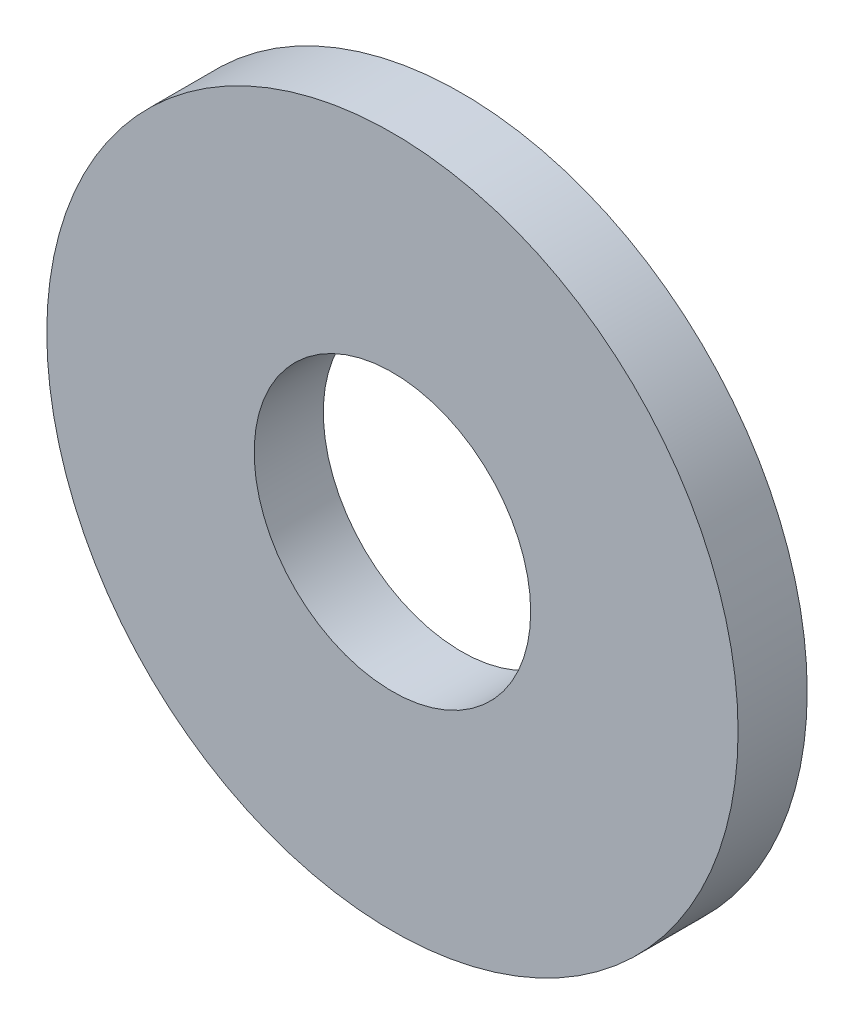
ISO-10303-21;
HEADER;
FILE_DESCRIPTION(('STEP AP214'),'2;1');
FILE_NAME('part.step','',(''),(''),'','','');
FILE_SCHEMA(('AUTOMOTIVE_DESIGN { 1 0 10303 214 1 1 1 1 }'));
ENDSEC;
DATA;
#1=APPLICATION_CONTEXT('core data for automotive mechanical design processes');
#2=APPLICATION_PROTOCOL_DEFINITION('international standard','automotive_design',2000,#1);
#3=PRODUCT_CONTEXT('',#1,'mechanical');
#4=PRODUCT('Part','Part','',(#3));
#5=PRODUCT_RELATED_PRODUCT_CATEGORY('part','',(#4));
#6=PRODUCT_DEFINITION_FORMATION('','',#4);
#7=PRODUCT_DEFINITION_CONTEXT('part definition',#1,'design');
#8=PRODUCT_DEFINITION('design','',#6,#7);
#9=PRODUCT_DEFINITION_SHAPE('','',#8);
#10=(LENGTH_UNIT() NAMED_UNIT(*) SI_UNIT(.MILLI.,.METRE.));
#11=(NAMED_UNIT(*) PLANE_ANGLE_UNIT() SI_UNIT($,.RADIAN.));
#12=(NAMED_UNIT(*) SI_UNIT($,.STERADIAN.) SOLID_ANGLE_UNIT());
#13=UNCERTAINTY_MEASURE_WITH_UNIT(LENGTH_MEASURE(1.E-05),#10,'distance_accuracy_value','');
#14=(GEOMETRIC_REPRESENTATION_CONTEXT(3) GLOBAL_UNCERTAINTY_ASSIGNED_CONTEXT((#13)) GLOBAL_UNIT_ASSIGNED_CONTEXT((#10,
#11,#12)) REPRESENTATION_CONTEXT('',''));
#15=CARTESIAN_POINT('',(0.,0.,0.));
#16=DIRECTION('',(0.,0.,1.));
#17=DIRECTION('',(1.,0.,0.));
#18=AXIS2_PLACEMENT_3D('',#15,#16,#17);
#19=CARTESIAN_POINT('',(0.,0.,1.));
#20=DIRECTION('',(0.,0.,1.));
#21=DIRECTION('',(1.,0.,0.));
#22=AXIS2_PLACEMENT_3D('',#19,#20,#21);
#23=PLANE('',#22);
#24=CARTESIAN_POINT('',(0.,0.,1.));
#25=DIRECTION('',(0.,0.,1.));
#26=DIRECTION('',(1.,0.,0.));
#27=AXIS2_PLACEMENT_3D('',#24,#25,#26);
#28=CIRCLE('',#27,5.);
#29=CARTESIAN_POINT('',(5.,0.,1.));
#30=VERTEX_POINT('',#29);
#31=EDGE_CURVE('E10',#30,#30,#28,.T.);
#32=ORIENTED_EDGE('',*,*,#31,.T.);
#33=EDGE_LOOP('',(#32));
#34=FACE_BOUND('',#33,.T.);
#35=CARTESIAN_POINT('',(0.,0.,1.));
#36=DIRECTION('',(0.,0.,1.));
#37=DIRECTION('',(1.,0.,0.));
#38=AXIS2_PLACEMENT_3D('',#35,#36,#37);
#39=CIRCLE('',#38,2.);
#40=CARTESIAN_POINT('',(2.,0.,1.));
#41=VERTEX_POINT('',#40);
#42=EDGE_CURVE('E42',#41,#41,#39,.T.);
#43=ORIENTED_EDGE('',*,*,#42,.F.);
#44=EDGE_LOOP('',(#43));
#45=FACE_BOUND('',#44,.T.);
#46=ADVANCED_FACE('F31',(#34,#45),#23,.T.);
#47=CARTESIAN_POINT('',(0.,0.,0.));
#48=DIRECTION('',(0.,0.,1.));
#49=DIRECTION('',(1.,0.,0.));
#50=AXIS2_PLACEMENT_3D('',#47,#48,#49);
#51=PLANE('',#50);
#52=CARTESIAN_POINT('',(0.,0.,0.));
#53=DIRECTION('',(0.,0.,1.));
#54=DIRECTION('',(1.,0.,0.));
#55=AXIS2_PLACEMENT_3D('',#52,#53,#54);
#56=CIRCLE('',#55,5.);
#57=CARTESIAN_POINT('',(5.,0.,0.));
#58=VERTEX_POINT('',#57);
#59=EDGE_CURVE('E35',#58,#58,#56,.T.);
#60=ORIENTED_EDGE('',*,*,#59,.F.);
#61=EDGE_LOOP('',(#60));
#62=FACE_BOUND('',#61,.T.);
#63=CARTESIAN_POINT('',(0.,0.,0.));
#64=DIRECTION('',(0.,0.,1.));
#65=DIRECTION('',(1.,0.,0.));
#66=AXIS2_PLACEMENT_3D('',#63,#64,#65);
#67=CIRCLE('',#66,2.);
#68=CARTESIAN_POINT('',(2.,0.,0.));
#69=VERTEX_POINT('',#68);
#70=EDGE_CURVE('E44',#69,#69,#67,.T.);
#71=ORIENTED_EDGE('',*,*,#70,.T.);
#72=EDGE_LOOP('',(#71));
#73=FACE_BOUND('',#72,.T.);
#74=ADVANCED_FACE('F54',(#62,#73),#51,.F.);
#75=CARTESIAN_POINT('',(0.,0.,1.));
#76=DIRECTION('',(0.,0.,-1.));
#77=DIRECTION('',(-1.,0.,0.));
#78=AXIS2_PLACEMENT_3D('',#75,#76,#77);
#79=CYLINDRICAL_SURFACE('',#78,5.);
#80=ORIENTED_EDGE('',*,*,#31,.F.);
#81=EDGE_LOOP('',(#80));
#82=FACE_BOUND('',#81,.T.);
#83=ORIENTED_EDGE('',*,*,#59,.T.);
#84=EDGE_LOOP('',(#83));
#85=FACE_BOUND('',#84,.T.);
#86=ADVANCED_FACE('F33',(#82,#85),#79,.T.);
#87=CARTESIAN_POINT('',(0.,0.,1.));
#88=DIRECTION('',(0.,0.,-1.));
#89=DIRECTION('',(-1.,0.,0.));
#90=AXIS2_PLACEMENT_3D('',#87,#88,#89);
#91=CYLINDRICAL_SURFACE('',#90,2.);
#92=ORIENTED_EDGE('',*,*,#42,.T.);
#93=EDGE_LOOP('',(#92));
#94=FACE_BOUND('',#93,.T.);
#95=ORIENTED_EDGE('',*,*,#70,.F.);
#96=EDGE_LOOP('',(#95));
#97=FACE_BOUND('',#96,.T.);
#98=ADVANCED_FACE('F50',(#94,#97),#91,.F.);
#99=CLOSED_SHELL('',(#46,#74,#86,#98));
#100=MANIFOLD_SOLID_BREP('B2',#99);
#101=ADVANCED_BREP_SHAPE_REPRESENTATION('',(#18,#100),#14);
#102=SHAPE_DEFINITION_REPRESENTATION(#9,#101);
ENDSEC;
END-ISO-10303-21;
